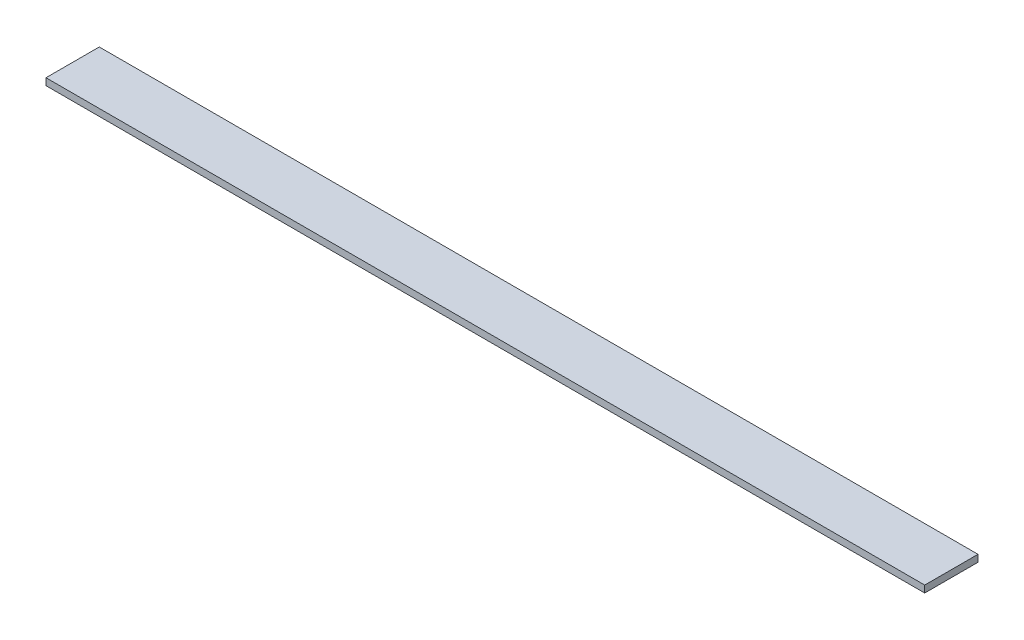
ISO-10303-21;
HEADER;
FILE_DESCRIPTION(('STEP AP214'),'2;1');
FILE_NAME('part.step','',(''),(''),'','','');
FILE_SCHEMA(('AUTOMOTIVE_DESIGN { 1 0 10303 214 1 1 1 1 }'));
ENDSEC;
DATA;
#1=APPLICATION_CONTEXT('core data for automotive mechanical design processes');
#2=APPLICATION_PROTOCOL_DEFINITION('international standard','automotive_design',2000,#1);
#3=PRODUCT_CONTEXT('',#1,'mechanical');
#4=PRODUCT('Part','Part','',(#3));
#5=PRODUCT_RELATED_PRODUCT_CATEGORY('part','',(#4));
#6=PRODUCT_DEFINITION_FORMATION('','',#4);
#7=PRODUCT_DEFINITION_CONTEXT('part definition',#1,'design');
#8=PRODUCT_DEFINITION('design','',#6,#7);
#9=PRODUCT_DEFINITION_SHAPE('','',#8);
#10=(LENGTH_UNIT() NAMED_UNIT(*) SI_UNIT(.MILLI.,.METRE.));
#11=(NAMED_UNIT(*) PLANE_ANGLE_UNIT() SI_UNIT($,.RADIAN.));
#12=(NAMED_UNIT(*) SI_UNIT($,.STERADIAN.) SOLID_ANGLE_UNIT());
#13=UNCERTAINTY_MEASURE_WITH_UNIT(LENGTH_MEASURE(1.E-05),#10,'distance_accuracy_value','');
#14=(GEOMETRIC_REPRESENTATION_CONTEXT(3) GLOBAL_UNCERTAINTY_ASSIGNED_CONTEXT((#13)) GLOBAL_UNIT_ASSIGNED_CONTEXT((#10,
#11,#12)) REPRESENTATION_CONTEXT('',''));
#15=CARTESIAN_POINT('',(0.,0.,0.));
#16=DIRECTION('',(0.,0.,1.));
#17=DIRECTION('',(1.,0.,0.));
#18=AXIS2_PLACEMENT_3D('',#15,#16,#17);
#19=CARTESIAN_POINT('',(322.58,0.,0.));
#20=DIRECTION('',(0.,0.,-1.));
#21=DIRECTION('',(0.,1.,0.));
#22=AXIS2_PLACEMENT_3D('',#19,#20,#21);
#23=PLANE('',#22);
#24=DIRECTION('',(0.,-1.,0.));
#25=VECTOR('',#24,1.);
#26=CARTESIAN_POINT('',(0.,0.,0.));
#27=LINE('',#26,#25);
#28=CARTESIAN_POINT('',(0.,2.54,0.));
#29=VERTEX_POINT('',#28);
#30=CARTESIAN_POINT('',(0.,0.,0.));
#31=VERTEX_POINT('',#30);
#32=EDGE_CURVE('E112',#29,#31,#27,.T.);
#33=ORIENTED_EDGE('',*,*,#32,.T.);
#34=DIRECTION('',(-1.,0.,0.));
#35=VECTOR('',#34,1.);
#36=CARTESIAN_POINT('',(322.58,0.,0.));
#37=LINE('',#36,#35);
#38=CARTESIAN_POINT('',(322.58,0.,0.));
#39=VERTEX_POINT('',#38);
#40=EDGE_CURVE('E11',#39,#31,#37,.T.);
#41=ORIENTED_EDGE('',*,*,#40,.F.);
#42=DIRECTION('',(0.,-1.,0.));
#43=VECTOR('',#42,1.);
#44=CARTESIAN_POINT('',(322.58,0.,0.));
#45=LINE('',#44,#43);
#46=CARTESIAN_POINT('',(322.58,2.54,0.));
#47=VERTEX_POINT('',#46);
#48=EDGE_CURVE('E95',#47,#39,#45,.T.);
#49=ORIENTED_EDGE('',*,*,#48,.F.);
#50=DIRECTION('',(-1.,0.,0.));
#51=VECTOR('',#50,1.);
#52=CARTESIAN_POINT('',(322.58,2.54,0.));
#53=LINE('',#52,#51);
#54=EDGE_CURVE('E108',#47,#29,#53,.T.);
#55=ORIENTED_EDGE('',*,*,#54,.T.);
#56=EDGE_LOOP('',(#33,#41,#49,#55));
#57=FACE_BOUND('',#56,.T.);
#58=ADVANCED_FACE('F43',(#57),#23,.F.);
#59=CARTESIAN_POINT('',(322.58,0.,0.));
#60=DIRECTION('',(0.,1.,0.));
#61=DIRECTION('',(0.,0.,1.));
#62=AXIS2_PLACEMENT_3D('',#59,#60,#61);
#63=PLANE('',#62);
#64=DIRECTION('',(0.,0.,-1.));
#65=VECTOR('',#64,1.);
#66=CARTESIAN_POINT('',(0.,0.,0.));
#67=LINE('',#66,#65);
#68=CARTESIAN_POINT('',(0.,0.,-19.558));
#69=VERTEX_POINT('',#68);
#70=EDGE_CURVE('E100',#31,#69,#67,.T.);
#71=ORIENTED_EDGE('',*,*,#70,.T.);
#72=DIRECTION('',(-1.,0.,0.));
#73=VECTOR('',#72,1.);
#74=CARTESIAN_POINT('',(322.58,0.,-19.558));
#75=LINE('',#74,#73);
#76=CARTESIAN_POINT('',(322.58,0.,-19.558));
#77=VERTEX_POINT('',#76);
#78=EDGE_CURVE('E52',#77,#69,#75,.T.);
#79=ORIENTED_EDGE('',*,*,#78,.F.);
#80=DIRECTION('',(0.,0.,-1.));
#81=VECTOR('',#80,1.);
#82=CARTESIAN_POINT('',(322.58,0.,0.));
#83=LINE('',#82,#81);
#84=EDGE_CURVE('E90',#39,#77,#83,.T.);
#85=ORIENTED_EDGE('',*,*,#84,.F.);
#86=ORIENTED_EDGE('',*,*,#40,.T.);
#87=EDGE_LOOP('',(#71,#79,#85,#86));
#88=FACE_BOUND('',#87,.T.);
#89=ADVANCED_FACE('F99',(#88),#63,.F.);
#90=CARTESIAN_POINT('',(322.58,0.,-19.558));
#91=DIRECTION('',(0.,0.,1.));
#92=DIRECTION('',(1.,0.,0.));
#93=AXIS2_PLACEMENT_3D('',#90,#91,#92);
#94=PLANE('',#93);
#95=DIRECTION('',(0.,1.,0.));
#96=VECTOR('',#95,1.);
#97=CARTESIAN_POINT('',(0.,0.,-19.558));
#98=LINE('',#97,#96);
#99=CARTESIAN_POINT('',(0.,2.54,-19.558));
#100=VERTEX_POINT('',#99);
#101=EDGE_CURVE('E77',#69,#100,#98,.T.);
#102=ORIENTED_EDGE('',*,*,#101,.T.);
#103=DIRECTION('',(-1.,0.,0.));
#104=VECTOR('',#103,1.);
#105=CARTESIAN_POINT('',(322.58,2.54,-19.558));
#106=LINE('',#105,#104);
#107=CARTESIAN_POINT('',(322.58,2.54,-19.558));
#108=VERTEX_POINT('',#107);
#109=EDGE_CURVE('E102',#108,#100,#106,.T.);
#110=ORIENTED_EDGE('',*,*,#109,.F.);
#111=DIRECTION('',(0.,1.,0.));
#112=VECTOR('',#111,1.);
#113=CARTESIAN_POINT('',(322.58,0.,-19.558));
#114=LINE('',#113,#112);
#115=EDGE_CURVE('E93',#77,#108,#114,.T.);
#116=ORIENTED_EDGE('',*,*,#115,.F.);
#117=ORIENTED_EDGE('',*,*,#78,.T.);
#118=EDGE_LOOP('',(#102,#110,#116,#117));
#119=FACE_BOUND('',#118,.T.);
#120=ADVANCED_FACE('F103',(#119),#94,.F.);
#121=CARTESIAN_POINT('',(322.58,2.54,0.));
#122=DIRECTION('',(0.,-1.,0.));
#123=DIRECTION('',(0.,0.,-1.));
#124=AXIS2_PLACEMENT_3D('',#121,#122,#123);
#125=PLANE('',#124);
#126=DIRECTION('',(0.,0.,1.));
#127=VECTOR('',#126,1.);
#128=CARTESIAN_POINT('',(0.,2.54,0.));
#129=LINE('',#128,#127);
#130=EDGE_CURVE('E83',#100,#29,#129,.T.);
#131=ORIENTED_EDGE('',*,*,#130,.T.);
#132=ORIENTED_EDGE('',*,*,#54,.F.);
#133=DIRECTION('',(0.,0.,1.));
#134=VECTOR('',#133,1.);
#135=CARTESIAN_POINT('',(322.58,2.54,0.));
#136=LINE('',#135,#134);
#137=EDGE_CURVE('E60',#108,#47,#136,.T.);
#138=ORIENTED_EDGE('',*,*,#137,.F.);
#139=ORIENTED_EDGE('',*,*,#109,.T.);
#140=EDGE_LOOP('',(#131,#132,#138,#139));
#141=FACE_BOUND('',#140,.T.);
#142=ADVANCED_FACE('F126',(#141),#125,.F.);
#143=CARTESIAN_POINT('',(322.58,0.,0.));
#144=DIRECTION('',(-1.,0.,0.));
#145=DIRECTION('',(0.,0.,1.));
#146=AXIS2_PLACEMENT_3D('',#143,#144,#145);
#147=PLANE('',#146);
#148=ORIENTED_EDGE('',*,*,#48,.T.);
#149=ORIENTED_EDGE('',*,*,#84,.T.);
#150=ORIENTED_EDGE('',*,*,#115,.T.);
#151=ORIENTED_EDGE('',*,*,#137,.T.);
#152=EDGE_LOOP('',(#148,#149,#150,#151));
#153=FACE_BOUND('',#152,.T.);
#154=ADVANCED_FACE('F91',(#153),#147,.F.);
#155=CARTESIAN_POINT('',(0.,0.,0.));
#156=DIRECTION('',(-1.,0.,0.));
#157=DIRECTION('',(0.,0.,1.));
#158=AXIS2_PLACEMENT_3D('',#155,#156,#157);
#159=PLANE('',#158);
#160=ORIENTED_EDGE('',*,*,#32,.F.);
#161=ORIENTED_EDGE('',*,*,#130,.F.);
#162=ORIENTED_EDGE('',*,*,#101,.F.);
#163=ORIENTED_EDGE('',*,*,#70,.F.);
#164=EDGE_LOOP('',(#160,#161,#162,#163));
#165=FACE_BOUND('',#164,.T.);
#166=ADVANCED_FACE('F129',(#165),#159,.T.);
#167=CLOSED_SHELL('',(#58,#89,#120,#142,#154,#166));
#168=MANIFOLD_SOLID_BREP('B2',#167);
#169=ADVANCED_BREP_SHAPE_REPRESENTATION('',(#18,#168),#14);
#170=SHAPE_DEFINITION_REPRESENTATION(#9,#169);
ENDSEC;
END-ISO-10303-21;
